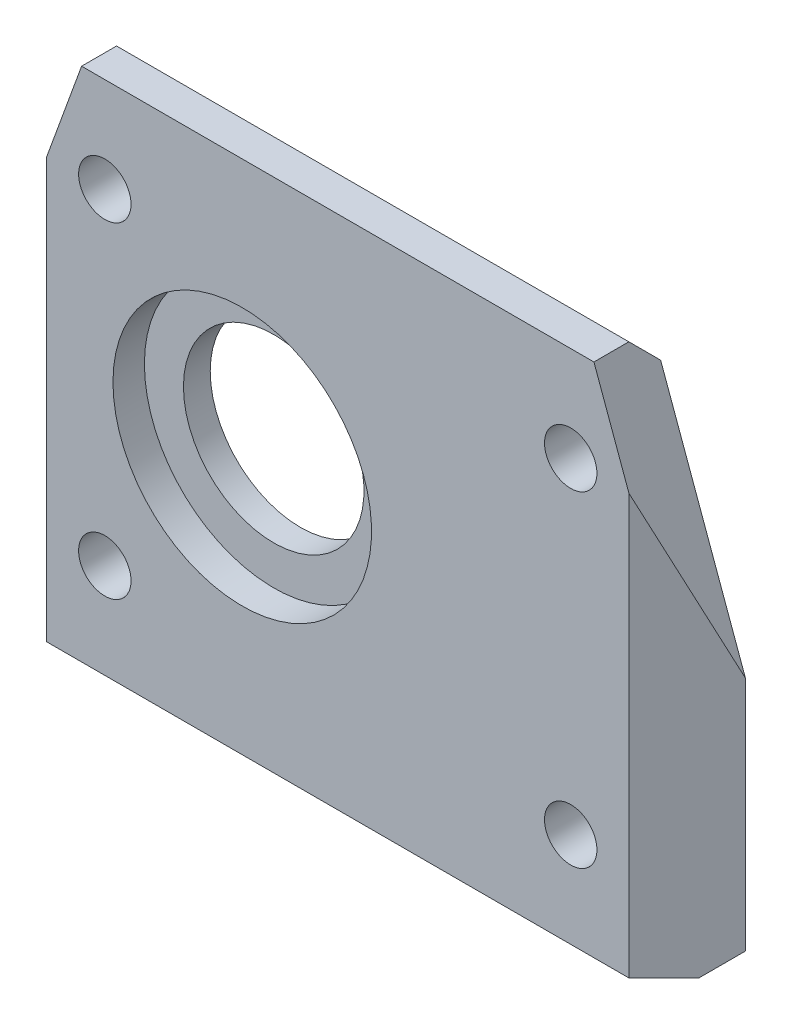
ISO-10303-21;
HEADER;
FILE_DESCRIPTION(('STEP AP214'),'2;1');
FILE_NAME('part.step','',(''),(''),'','','');
FILE_SCHEMA(('AUTOMOTIVE_DESIGN { 1 0 10303 214 1 1 1 1 }'));
ENDSEC;
DATA;
#1=APPLICATION_CONTEXT('core data for automotive mechanical design processes');
#2=APPLICATION_PROTOCOL_DEFINITION('international standard','automotive_design',2000,#1);
#3=PRODUCT_CONTEXT('',#1,'mechanical');
#4=PRODUCT('Part','Part','',(#3));
#5=PRODUCT_RELATED_PRODUCT_CATEGORY('part','',(#4));
#6=PRODUCT_DEFINITION_FORMATION('','',#4);
#7=PRODUCT_DEFINITION_CONTEXT('part definition',#1,'design');
#8=PRODUCT_DEFINITION('design','',#6,#7);
#9=PRODUCT_DEFINITION_SHAPE('','',#8);
#10=(LENGTH_UNIT() NAMED_UNIT(*) SI_UNIT(.MILLI.,.METRE.));
#11=(NAMED_UNIT(*) PLANE_ANGLE_UNIT() SI_UNIT($,.RADIAN.));
#12=(NAMED_UNIT(*) SI_UNIT($,.STERADIAN.) SOLID_ANGLE_UNIT());
#13=UNCERTAINTY_MEASURE_WITH_UNIT(LENGTH_MEASURE(1.E-05),#10,'distance_accuracy_value','');
#14=(GEOMETRIC_REPRESENTATION_CONTEXT(3) GLOBAL_UNCERTAINTY_ASSIGNED_CONTEXT((#13)) GLOBAL_UNIT_ASSIGNED_CONTEXT((#10,
#11,#12)) REPRESENTATION_CONTEXT('',''));
#15=CARTESIAN_POINT('',(0.,0.,0.));
#16=DIRECTION('',(0.,0.,1.));
#17=DIRECTION('',(1.,0.,0.));
#18=AXIS2_PLACEMENT_3D('',#15,#16,#17);
#19=CARTESIAN_POINT('',(-8.2,0.,-5.));
#20=DIRECTION('',(0.,0.,1.));
#21=DIRECTION('',(-1.,0.,0.));
#22=AXIS2_PLACEMENT_3D('',#19,#20,#21);
#23=CYLINDRICAL_SURFACE('',#22,7.75);
#24=CARTESIAN_POINT('',(-8.2,0.,-5.));
#25=DIRECTION('',(0.,0.,1.));
#26=DIRECTION('',(1.,0.,0.));
#27=AXIS2_PLACEMENT_3D('',#24,#25,#26);
#28=CIRCLE('',#27,7.75);
#29=CARTESIAN_POINT('',(-0.450000000000001,0.,-5.));
#30=VERTEX_POINT('',#29);
#31=EDGE_CURVE('E241',#30,#30,#28,.T.);
#32=ORIENTED_EDGE('',*,*,#31,.F.);
#33=EDGE_LOOP('',(#32));
#34=FACE_BOUND('',#33,.T.);
#35=CARTESIAN_POINT('',(-8.2,0.,-2.7));
#36=DIRECTION('',(0.,0.,-1.));
#37=DIRECTION('',(-1.,0.,0.));
#38=AXIS2_PLACEMENT_3D('',#35,#36,#37);
#39=CIRCLE('',#38,7.75);
#40=CARTESIAN_POINT('',(-15.95,0.,-2.7));
#41=VERTEX_POINT('',#40);
#42=EDGE_CURVE('E180',#41,#41,#39,.T.);
#43=ORIENTED_EDGE('',*,*,#42,.F.);
#44=EDGE_LOOP('',(#43));
#45=FACE_BOUND('',#44,.T.);
#46=ADVANCED_FACE('F37',(#34,#45),#23,.F.);
#47=CARTESIAN_POINT('',(-20.,14.,-5.));
#48=DIRECTION('',(0.,0.,1.));
#49=DIRECTION('',(-1.,0.,0.));
#50=AXIS2_PLACEMENT_3D('',#47,#48,#49);
#51=CYLINDRICAL_SURFACE('',#50,2.25);
#52=CARTESIAN_POINT('',(-20.,14.,0.));
#53=DIRECTION('',(0.,0.,1.));
#54=DIRECTION('',(1.,0.,0.));
#55=AXIS2_PLACEMENT_3D('',#52,#53,#54);
#56=CIRCLE('',#55,2.25);
#57=CARTESIAN_POINT('',(-17.75,14.,0.));
#58=VERTEX_POINT('',#57);
#59=EDGE_CURVE('E121',#58,#58,#56,.T.);
#60=ORIENTED_EDGE('',*,*,#59,.T.);
#61=EDGE_LOOP('',(#60));
#62=FACE_BOUND('',#61,.T.);
#63=CARTESIAN_POINT('',(-20.,14.,-4.));
#64=DIRECTION('',(0.,0.,1.));
#65=DIRECTION('',(1.,0.,0.));
#66=AXIS2_PLACEMENT_3D('',#63,#64,#65);
#67=CIRCLE('',#66,2.25);
#68=CARTESIAN_POINT('',(-17.75,14.,-4.));
#69=VERTEX_POINT('',#68);
#70=EDGE_CURVE('E202',#69,#69,#67,.T.);
#71=ORIENTED_EDGE('',*,*,#70,.F.);
#72=EDGE_LOOP('',(#71));
#73=FACE_BOUND('',#72,.T.);
#74=ADVANCED_FACE('F255',(#62,#73),#51,.F.);
#75=CARTESIAN_POINT('',(20.,14.,-5.));
#76=DIRECTION('',(0.,0.,1.));
#77=DIRECTION('',(-1.,0.,0.));
#78=AXIS2_PLACEMENT_3D('',#75,#76,#77);
#79=CYLINDRICAL_SURFACE('',#78,2.25);
#80=CARTESIAN_POINT('',(20.,14.,0.));
#81=DIRECTION('',(0.,0.,1.));
#82=DIRECTION('',(1.,0.,0.));
#83=AXIS2_PLACEMENT_3D('',#80,#81,#82);
#84=CIRCLE('',#83,2.25);
#85=CARTESIAN_POINT('',(22.25,14.,0.));
#86=VERTEX_POINT('',#85);
#87=EDGE_CURVE('E247',#86,#86,#84,.T.);
#88=ORIENTED_EDGE('',*,*,#87,.T.);
#89=EDGE_LOOP('',(#88));
#90=FACE_BOUND('',#89,.T.);
#91=CARTESIAN_POINT('',(20.,14.,-4.));
#92=DIRECTION('',(0.,0.,1.));
#93=DIRECTION('',(1.,0.,0.));
#94=AXIS2_PLACEMENT_3D('',#91,#92,#93);
#95=CIRCLE('',#94,2.25);
#96=CARTESIAN_POINT('',(22.25,14.,-4.));
#97=VERTEX_POINT('',#96);
#98=EDGE_CURVE('E214',#97,#97,#95,.T.);
#99=ORIENTED_EDGE('',*,*,#98,.F.);
#100=EDGE_LOOP('',(#99));
#101=FACE_BOUND('',#100,.T.);
#102=ADVANCED_FACE('F263',(#90,#101),#79,.F.);
#103=CARTESIAN_POINT('',(20.,-14.,-5.));
#104=DIRECTION('',(0.,0.,1.));
#105=DIRECTION('',(-1.,0.,0.));
#106=AXIS2_PLACEMENT_3D('',#103,#104,#105);
#107=CYLINDRICAL_SURFACE('',#106,2.25);
#108=CARTESIAN_POINT('',(20.,-14.,0.));
#109=DIRECTION('',(0.,0.,1.));
#110=DIRECTION('',(1.,0.,0.));
#111=AXIS2_PLACEMENT_3D('',#108,#109,#110);
#112=CIRCLE('',#111,2.25);
#113=CARTESIAN_POINT('',(22.25,-14.,0.));
#114=VERTEX_POINT('',#113);
#115=EDGE_CURVE('E244',#114,#114,#112,.T.);
#116=ORIENTED_EDGE('',*,*,#115,.T.);
#117=EDGE_LOOP('',(#116));
#118=FACE_BOUND('',#117,.T.);
#119=CARTESIAN_POINT('',(20.,-14.,-4.));
#120=DIRECTION('',(0.,0.,1.));
#121=DIRECTION('',(1.,0.,0.));
#122=AXIS2_PLACEMENT_3D('',#119,#120,#121);
#123=CIRCLE('',#122,2.25);
#124=CARTESIAN_POINT('',(22.25,-14.,-4.));
#125=VERTEX_POINT('',#124);
#126=EDGE_CURVE('E226',#125,#125,#123,.T.);
#127=ORIENTED_EDGE('',*,*,#126,.F.);
#128=EDGE_LOOP('',(#127));
#129=FACE_BOUND('',#128,.T.);
#130=ADVANCED_FACE('F266',(#118,#129),#107,.F.);
#131=CARTESIAN_POINT('',(0.,0.,-5.));
#132=DIRECTION('',(0.,0.,1.));
#133=DIRECTION('',(-1.,0.,0.));
#134=AXIS2_PLACEMENT_3D('',#131,#132,#133);
#135=PLANE('',#134);
#136=CARTESIAN_POINT('',(-20.,14.,-5.));
#137=DIRECTION('',(0.,0.,1.));
#138=DIRECTION('',(1.,0.,0.));
#139=AXIS2_PLACEMENT_3D('',#136,#137,#138);
#140=CIRCLE('',#139,4.025);
#141=CARTESIAN_POINT('',(-15.975,14.,-5.));
#142=VERTEX_POINT('',#141);
#143=EDGE_CURVE('E182',#142,#142,#140,.T.);
#144=ORIENTED_EDGE('',*,*,#143,.T.);
#145=EDGE_LOOP('',(#144));
#146=FACE_BOUND('',#145,.T.);
#147=CARTESIAN_POINT('',(20.,14.,-5.));
#148=DIRECTION('',(0.,0.,1.));
#149=DIRECTION('',(1.,0.,0.));
#150=AXIS2_PLACEMENT_3D('',#147,#148,#149);
#151=CIRCLE('',#150,4.025);
#152=CARTESIAN_POINT('',(24.025,14.,-5.));
#153=VERTEX_POINT('',#152);
#154=EDGE_CURVE('E205',#153,#153,#151,.T.);
#155=ORIENTED_EDGE('',*,*,#154,.T.);
#156=EDGE_LOOP('',(#155));
#157=FACE_BOUND('',#156,.T.);
#158=ORIENTED_EDGE('',*,*,#31,.T.);
#159=EDGE_LOOP('',(#158));
#160=FACE_BOUND('',#159,.T.);
#161=DIRECTION('',(0.,-1.,0.));
#162=VECTOR('',#161,1.);
#163=CARTESIAN_POINT('',(-30.,-22.15,-5.));
#164=LINE('',#163,#162);
#165=CARTESIAN_POINT('',(-30.,0.149999999999786,-5.));
#166=VERTEX_POINT('',#165);
#167=CARTESIAN_POINT('',(-30.,-20.15,-5.));
#168=VERTEX_POINT('',#167);
#169=EDGE_CURVE('E163',#166,#168,#164,.T.);
#170=ORIENTED_EDGE('',*,*,#169,.F.);
#171=DIRECTION('',(0.342020143325667,0.939692620785909,0.));
#172=VECTOR('',#171,1.);
#173=CARTESIAN_POINT('',(-30.,0.149999999999786,-5.));
#174=LINE('',#173,#172);
#175=CARTESIAN_POINT('',(-22.7205953146759,20.15,-5.));
#176=VERTEX_POINT('',#175);
#177=EDGE_CURVE('E127',#176,#166,#174,.F.);
#178=ORIENTED_EDGE('',*,*,#177,.F.);
#179=DIRECTION('',(-1.,0.,0.));
#180=VECTOR('',#179,1.);
#181=CARTESIAN_POINT('',(0.,20.15,-5.));
#182=LINE('',#181,#180);
#183=CARTESIAN_POINT('',(22.7205953146759,20.15,-5.));
#184=VERTEX_POINT('',#183);
#185=EDGE_CURVE('E134',#184,#176,#182,.T.);
#186=ORIENTED_EDGE('',*,*,#185,.F.);
#187=DIRECTION('',(0.342020143325666,-0.939692620785909,0.));
#188=VECTOR('',#187,1.);
#189=CARTESIAN_POINT('',(21.9926548461435,22.15,-5.));
#190=LINE('',#189,#188);
#191=CARTESIAN_POINT('',(30.,0.149999999999786,-5.));
#192=VERTEX_POINT('',#191);
#193=EDGE_CURVE('E129',#192,#184,#190,.F.);
#194=ORIENTED_EDGE('',*,*,#193,.F.);
#195=DIRECTION('',(0.,1.,0.));
#196=VECTOR('',#195,1.);
#197=CARTESIAN_POINT('',(30.,-22.15,-5.));
#198=LINE('',#197,#196);
#199=CARTESIAN_POINT('',(30.,-20.15,-5.));
#200=VERTEX_POINT('',#199);
#201=EDGE_CURVE('E173',#200,#192,#198,.T.);
#202=ORIENTED_EDGE('',*,*,#201,.F.);
#203=DIRECTION('',(1.,0.,0.));
#204=VECTOR('',#203,1.);
#205=CARTESIAN_POINT('',(0.,-20.15,-5.));
#206=LINE('',#205,#204);
#207=EDGE_CURVE('E137',#168,#200,#206,.T.);
#208=ORIENTED_EDGE('',*,*,#207,.F.);
#209=EDGE_LOOP('',(#170,#178,#186,#194,#202,#208));
#210=FACE_BOUND('',#209,.T.);
#211=CARTESIAN_POINT('',(-20.,-14.,-5.));
#212=DIRECTION('',(0.,0.,1.));
#213=DIRECTION('',(1.,0.,0.));
#214=AXIS2_PLACEMENT_3D('',#211,#212,#213);
#215=CIRCLE('',#214,4.025);
#216=CARTESIAN_POINT('',(-15.975,-14.,-5.));
#217=VERTEX_POINT('',#216);
#218=EDGE_CURVE('E229',#217,#217,#215,.T.);
#219=ORIENTED_EDGE('',*,*,#218,.T.);
#220=EDGE_LOOP('',(#219));
#221=FACE_BOUND('',#220,.T.);
#222=CARTESIAN_POINT('',(20.,-14.,-5.));
#223=DIRECTION('',(0.,0.,1.));
#224=DIRECTION('',(1.,0.,0.));
#225=AXIS2_PLACEMENT_3D('',#222,#223,#224);
#226=CIRCLE('',#225,4.025);
#227=CARTESIAN_POINT('',(24.025,-14.,-5.));
#228=VERTEX_POINT('',#227);
#229=EDGE_CURVE('E217',#228,#228,#226,.T.);
#230=ORIENTED_EDGE('',*,*,#229,.T.);
#231=EDGE_LOOP('',(#230));
#232=FACE_BOUND('',#231,.T.);
#233=ADVANCED_FACE('F170',(#146,#157,#160,#210,#221,#232),#135,.F.);
#234=CARTESIAN_POINT('',(0.,0.,0.));
#235=DIRECTION('',(0.,0.,1.));
#236=DIRECTION('',(-1.,0.,0.));
#237=AXIS2_PLACEMENT_3D('',#234,#235,#236);
#238=PLANE('',#237);
#239=CARTESIAN_POINT('',(-8.2,0.,0.));
#240=DIRECTION('',(0.,0.,-1.));
#241=DIRECTION('',(-1.,0.,0.));
#242=AXIS2_PLACEMENT_3D('',#239,#240,#241);
#243=CIRCLE('',#242,11.1);
#244=CARTESIAN_POINT('',(-19.3,0.,0.));
#245=VERTEX_POINT('',#244);
#246=EDGE_CURVE('E190',#245,#245,#243,.T.);
#247=ORIENTED_EDGE('',*,*,#246,.T.);
#248=EDGE_LOOP('',(#247));
#249=FACE_BOUND('',#248,.T.);
#250=ORIENTED_EDGE('',*,*,#115,.F.);
#251=EDGE_LOOP('',(#250));
#252=FACE_BOUND('',#251,.T.);
#253=CARTESIAN_POINT('',(-20.,-14.,0.));
#254=DIRECTION('',(0.,0.,1.));
#255=DIRECTION('',(1.,0.,0.));
#256=AXIS2_PLACEMENT_3D('',#253,#254,#255);
#257=CIRCLE('',#256,2.25);
#258=CARTESIAN_POINT('',(-17.75,-14.,0.));
#259=VERTEX_POINT('',#258);
#260=EDGE_CURVE('E250',#259,#259,#257,.T.);
#261=ORIENTED_EDGE('',*,*,#260,.F.);
#262=EDGE_LOOP('',(#261));
#263=FACE_BOUND('',#262,.T.);
#264=DIRECTION('',(1.,0.,0.));
#265=VECTOR('',#264,1.);
#266=CARTESIAN_POINT('',(-30.,-22.15,0.));
#267=LINE('',#266,#265);
#268=CARTESIAN_POINT('',(-25.,-22.15,0.));
#269=VERTEX_POINT('',#268);
#270=CARTESIAN_POINT('',(25.,-22.15,0.));
#271=VERTEX_POINT('',#270);
#272=EDGE_CURVE('E120',#269,#271,#267,.T.);
#273=ORIENTED_EDGE('',*,*,#272,.T.);
#274=DIRECTION('',(0.,-1.,0.));
#275=VECTOR('',#274,1.);
#276=CARTESIAN_POINT('',(25.,-22.15,0.));
#277=LINE('',#276,#275);
#278=CARTESIAN_POINT('',(25.,13.887387097273,0.));
#279=VERTEX_POINT('',#278);
#280=EDGE_CURVE('E126',#279,#271,#277,.T.);
#281=ORIENTED_EDGE('',*,*,#280,.F.);
#282=DIRECTION('',(-0.342020143325666,0.939692620785909,0.));
#283=VECTOR('',#282,1.);
#284=CARTESIAN_POINT('',(26.5388757175111,9.65936081206408,0.));
#285=LINE('',#284,#283);
#286=CARTESIAN_POINT('',(21.9926548461435,22.15,0.));
#287=VERTEX_POINT('',#286);
#288=EDGE_CURVE('E105',#287,#279,#285,.F.);
#289=ORIENTED_EDGE('',*,*,#288,.F.);
#290=DIRECTION('',(-1.,0.,0.));
#291=VECTOR('',#290,1.);
#292=CARTESIAN_POINT('',(-30.,22.15,0.));
#293=LINE('',#292,#291);
#294=CARTESIAN_POINT('',(-21.9926548461435,22.15,0.));
#295=VERTEX_POINT('',#294);
#296=EDGE_CURVE('E115',#287,#295,#293,.T.);
#297=ORIENTED_EDGE('',*,*,#296,.T.);
#298=DIRECTION('',(-0.342020143325667,-0.939692620785909,0.));
#299=VECTOR('',#298,1.);
#300=CARTESIAN_POINT('',(-26.5388757175111,9.65936081206409,0.));
#301=LINE('',#300,#299);
#302=CARTESIAN_POINT('',(-25.,13.887387097273,0.));
#303=VERTEX_POINT('',#302);
#304=EDGE_CURVE('E111',#303,#295,#301,.F.);
#305=ORIENTED_EDGE('',*,*,#304,.F.);
#306=DIRECTION('',(0.,1.,0.));
#307=VECTOR('',#306,1.);
#308=CARTESIAN_POINT('',(-25.,0.149999999999786,0.));
#309=LINE('',#308,#307);
#310=EDGE_CURVE('E158',#269,#303,#309,.T.);
#311=ORIENTED_EDGE('',*,*,#310,.F.);
#312=EDGE_LOOP('',(#273,#281,#289,#297,#305,#311));
#313=FACE_BOUND('',#312,.T.);
#314=ORIENTED_EDGE('',*,*,#59,.F.);
#315=EDGE_LOOP('',(#314));
#316=FACE_BOUND('',#315,.T.);
#317=ORIENTED_EDGE('',*,*,#87,.F.);
#318=EDGE_LOOP('',(#317));
#319=FACE_BOUND('',#318,.T.);
#320=ADVANCED_FACE('F124',(#249,#252,#263,#313,#316,#319),#238,.T.);
#321=CARTESIAN_POINT('',(-30.,22.15,-5.));
#322=DIRECTION('',(0.,-1.,0.));
#323=DIRECTION('',(0.,0.,1.));
#324=AXIS2_PLACEMENT_3D('',#321,#322,#323);
#325=PLANE('',#324);
#326=DIRECTION('',(0.,0.,-1.));
#327=VECTOR('',#326,1.);
#328=CARTESIAN_POINT('',(-21.9926548461435,22.15,-5.));
#329=LINE('',#328,#327);
#330=CARTESIAN_POINT('',(-21.9926548461435,22.15,-2.99999999999999));
#331=VERTEX_POINT('',#330);
#332=EDGE_CURVE('E112',#295,#331,#329,.T.);
#333=ORIENTED_EDGE('',*,*,#332,.F.);
#334=ORIENTED_EDGE('',*,*,#296,.F.);
#335=DIRECTION('',(0.,0.,1.));
#336=VECTOR('',#335,1.);
#337=CARTESIAN_POINT('',(21.9926548461435,22.15,-5.));
#338=LINE('',#337,#336);
#339=CARTESIAN_POINT('',(21.9926548461435,22.15,-2.99999999999999));
#340=VERTEX_POINT('',#339);
#341=EDGE_CURVE('E100',#340,#287,#338,.T.);
#342=ORIENTED_EDGE('',*,*,#341,.F.);
#343=DIRECTION('',(1.,0.,0.));
#344=VECTOR('',#343,1.);
#345=CARTESIAN_POINT('',(-30.,22.15,-2.99999999999999));
#346=LINE('',#345,#344);
#347=EDGE_CURVE('E145',#331,#340,#346,.T.);
#348=ORIENTED_EDGE('',*,*,#347,.F.);
#349=EDGE_LOOP('',(#333,#334,#342,#348));
#350=FACE_BOUND('',#349,.T.);
#351=ADVANCED_FACE('F116',(#350),#325,.F.);
#352=CARTESIAN_POINT('',(-30.,-22.15,-5.));
#353=DIRECTION('',(0.,1.,0.));
#354=DIRECTION('',(0.,0.,-1.));
#355=AXIS2_PLACEMENT_3D('',#352,#353,#354);
#356=PLANE('',#355);
#357=DIRECTION('',(-1.,0.,0.));
#358=VECTOR('',#357,1.);
#359=CARTESIAN_POINT('',(-30.,-22.15,-2.99999999999999));
#360=LINE('',#359,#358);
#361=CARTESIAN_POINT('',(28.,-22.15,-2.99999999999999));
#362=VERTEX_POINT('',#361);
#363=CARTESIAN_POINT('',(-28.,-22.15,-2.99999999999999));
#364=VERTEX_POINT('',#363);
#365=EDGE_CURVE('E140',#362,#364,#360,.T.);
#366=ORIENTED_EDGE('',*,*,#365,.F.);
#367=DIRECTION('',(0.707106781186548,0.,-0.707106781186547));
#368=VECTOR('',#367,1.);
#369=CARTESIAN_POINT('',(30.,-22.15,-5.));
#370=LINE('',#369,#368);
#371=EDGE_CURVE('E152',#271,#362,#370,.T.);
#372=ORIENTED_EDGE('',*,*,#371,.F.);
#373=ORIENTED_EDGE('',*,*,#272,.F.);
#374=DIRECTION('',(0.707106781186548,0.,0.707106781186547));
#375=VECTOR('',#374,1.);
#376=CARTESIAN_POINT('',(-30.,-22.15,-5.));
#377=LINE('',#376,#375);
#378=EDGE_CURVE('E155',#364,#269,#377,.T.);
#379=ORIENTED_EDGE('',*,*,#378,.F.);
#380=EDGE_LOOP('',(#366,#372,#373,#379));
#381=FACE_BOUND('',#380,.T.);
#382=ADVANCED_FACE('F312',(#381),#356,.F.);
#383=CARTESIAN_POINT('',(-20.,-14.,-5.));
#384=DIRECTION('',(0.,0.,1.));
#385=DIRECTION('',(-1.,0.,0.));
#386=AXIS2_PLACEMENT_3D('',#383,#384,#385);
#387=CYLINDRICAL_SURFACE('',#386,2.25);
#388=CARTESIAN_POINT('',(-20.,-14.,-4.));
#389=DIRECTION('',(0.,0.,1.));
#390=DIRECTION('',(1.,0.,0.));
#391=AXIS2_PLACEMENT_3D('',#388,#389,#390);
#392=CIRCLE('',#391,2.25);
#393=CARTESIAN_POINT('',(-17.75,-14.,-4.));
#394=VERTEX_POINT('',#393);
#395=EDGE_CURVE('E238',#394,#394,#392,.T.);
#396=ORIENTED_EDGE('',*,*,#395,.F.);
#397=EDGE_LOOP('',(#396));
#398=FACE_BOUND('',#397,.T.);
#399=ORIENTED_EDGE('',*,*,#260,.T.);
#400=EDGE_LOOP('',(#399));
#401=FACE_BOUND('',#400,.T.);
#402=ADVANCED_FACE('F310',(#398,#401),#387,.F.);
#403=CARTESIAN_POINT('',(-16.,-14.,-4.));
#404=DIRECTION('',(0.,0.,1.));
#405=DIRECTION('',(-1.,0.,0.));
#406=AXIS2_PLACEMENT_3D('',#403,#404,#405);
#407=PLANE('',#406);
#408=ORIENTED_EDGE('',*,*,#395,.T.);
#409=EDGE_LOOP('',(#408));
#410=FACE_BOUND('',#409,.T.);
#411=CARTESIAN_POINT('',(-20.,-14.,-4.));
#412=DIRECTION('',(0.,0.,1.));
#413=DIRECTION('',(1.,0.,0.));
#414=AXIS2_PLACEMENT_3D('',#411,#412,#413);
#415=CIRCLE('',#414,4.);
#416=CARTESIAN_POINT('',(-16.,-14.,-4.));
#417=VERTEX_POINT('',#416);
#418=EDGE_CURVE('E235',#417,#417,#415,.T.);
#419=ORIENTED_EDGE('',*,*,#418,.F.);
#420=EDGE_LOOP('',(#419));
#421=FACE_BOUND('',#420,.T.);
#422=ADVANCED_FACE('F305',(#410,#421),#407,.F.);
#423=CARTESIAN_POINT('',(-20.,-14.,-5.));
#424=DIRECTION('',(0.,0.,-1.));
#425=DIRECTION('',(1.,0.,0.));
#426=AXIS2_PLACEMENT_3D('',#423,#424,#425);
#427=CYLINDRICAL_SURFACE('',#426,4.);
#428=ORIENTED_EDGE('',*,*,#418,.T.);
#429=EDGE_LOOP('',(#428));
#430=FACE_BOUND('',#429,.T.);
#431=CARTESIAN_POINT('',(-20.,-14.,-4.975));
#432=DIRECTION('',(0.,0.,1.));
#433=DIRECTION('',(1.,0.,0.));
#434=AXIS2_PLACEMENT_3D('',#431,#432,#433);
#435=CIRCLE('',#434,4.);
#436=CARTESIAN_POINT('',(-16.,-14.,-4.975));
#437=VERTEX_POINT('',#436);
#438=EDGE_CURVE('E232',#437,#437,#435,.T.);
#439=ORIENTED_EDGE('',*,*,#438,.F.);
#440=EDGE_LOOP('',(#439));
#441=FACE_BOUND('',#440,.T.);
#442=ADVANCED_FACE('F473',(#430,#441),#427,.F.);
#443=CARTESIAN_POINT('',(-20.,-14.,-5.));
#444=DIRECTION('',(0.,0.,-1.));
#445=DIRECTION('',(1.,0.,0.));
#446=AXIS2_PLACEMENT_3D('',#443,#444,#445);
#447=CONICAL_SURFACE('',#446,4.025,0.785398163397431);
#448=ORIENTED_EDGE('',*,*,#438,.T.);
#449=EDGE_LOOP('',(#448));
#450=FACE_BOUND('',#449,.T.);
#451=ORIENTED_EDGE('',*,*,#218,.F.);
#452=EDGE_LOOP('',(#451));
#453=FACE_BOUND('',#452,.T.);
#454=ADVANCED_FACE('F463',(#450,#453),#447,.F.);
#455=CARTESIAN_POINT('',(24.,-14.,-4.));
#456=DIRECTION('',(0.,0.,1.));
#457=DIRECTION('',(-1.,0.,0.));
#458=AXIS2_PLACEMENT_3D('',#455,#456,#457);
#459=PLANE('',#458);
#460=ORIENTED_EDGE('',*,*,#126,.T.);
#461=EDGE_LOOP('',(#460));
#462=FACE_BOUND('',#461,.T.);
#463=CARTESIAN_POINT('',(20.,-14.,-4.));
#464=DIRECTION('',(0.,0.,1.));
#465=DIRECTION('',(1.,0.,0.));
#466=AXIS2_PLACEMENT_3D('',#463,#464,#465);
#467=CIRCLE('',#466,4.);
#468=CARTESIAN_POINT('',(24.,-14.,-4.));
#469=VERTEX_POINT('',#468);
#470=EDGE_CURVE('E223',#469,#469,#467,.T.);
#471=ORIENTED_EDGE('',*,*,#470,.F.);
#472=EDGE_LOOP('',(#471));
#473=FACE_BOUND('',#472,.T.);
#474=ADVANCED_FACE('F453',(#462,#473),#459,.F.);
#475=CARTESIAN_POINT('',(20.,-14.,-5.));
#476=DIRECTION('',(0.,0.,-1.));
#477=DIRECTION('',(1.,0.,0.));
#478=AXIS2_PLACEMENT_3D('',#475,#476,#477);
#479=CYLINDRICAL_SURFACE('',#478,4.);
#480=ORIENTED_EDGE('',*,*,#470,.T.);
#481=EDGE_LOOP('',(#480));
#482=FACE_BOUND('',#481,.T.);
#483=CARTESIAN_POINT('',(20.,-14.,-4.975));
#484=DIRECTION('',(0.,0.,1.));
#485=DIRECTION('',(1.,0.,0.));
#486=AXIS2_PLACEMENT_3D('',#483,#484,#485);
#487=CIRCLE('',#486,4.);
#488=CARTESIAN_POINT('',(24.,-14.,-4.975));
#489=VERTEX_POINT('',#488);
#490=EDGE_CURVE('E220',#489,#489,#487,.T.);
#491=ORIENTED_EDGE('',*,*,#490,.F.);
#492=EDGE_LOOP('',(#491));
#493=FACE_BOUND('',#492,.T.);
#494=ADVANCED_FACE('F443',(#482,#493),#479,.F.);
#495=CARTESIAN_POINT('',(20.,-14.,-5.));
#496=DIRECTION('',(0.,0.,-1.));
#497=DIRECTION('',(1.,0.,0.));
#498=AXIS2_PLACEMENT_3D('',#495,#496,#497);
#499=CONICAL_SURFACE('',#498,4.025,0.785398163397431);
#500=ORIENTED_EDGE('',*,*,#490,.T.);
#501=EDGE_LOOP('',(#500));
#502=FACE_BOUND('',#501,.T.);
#503=ORIENTED_EDGE('',*,*,#229,.F.);
#504=EDGE_LOOP('',(#503));
#505=FACE_BOUND('',#504,.T.);
#506=ADVANCED_FACE('F274',(#502,#505),#499,.F.);
#507=CARTESIAN_POINT('',(24.,14.,-4.));
#508=DIRECTION('',(0.,0.,1.));
#509=DIRECTION('',(-1.,0.,0.));
#510=AXIS2_PLACEMENT_3D('',#507,#508,#509);
#511=PLANE('',#510);
#512=ORIENTED_EDGE('',*,*,#98,.T.);
#513=EDGE_LOOP('',(#512));
#514=FACE_BOUND('',#513,.T.);
#515=CARTESIAN_POINT('',(20.,14.,-4.));
#516=DIRECTION('',(0.,0.,1.));
#517=DIRECTION('',(1.,0.,0.));
#518=AXIS2_PLACEMENT_3D('',#515,#516,#517);
#519=CIRCLE('',#518,4.);
#520=CARTESIAN_POINT('',(24.,14.,-4.));
#521=VERTEX_POINT('',#520);
#522=EDGE_CURVE('E211',#521,#521,#519,.T.);
#523=ORIENTED_EDGE('',*,*,#522,.F.);
#524=EDGE_LOOP('',(#523));
#525=FACE_BOUND('',#524,.T.);
#526=ADVANCED_FACE('F270',(#514,#525),#511,.F.);
#527=CARTESIAN_POINT('',(20.,14.,-5.));
#528=DIRECTION('',(0.,0.,-1.));
#529=DIRECTION('',(1.,0.,0.));
#530=AXIS2_PLACEMENT_3D('',#527,#528,#529);
#531=CYLINDRICAL_SURFACE('',#530,4.);
#532=ORIENTED_EDGE('',*,*,#522,.T.);
#533=EDGE_LOOP('',(#532));
#534=FACE_BOUND('',#533,.T.);
#535=CARTESIAN_POINT('',(20.,14.,-4.975));
#536=DIRECTION('',(0.,0.,1.));
#537=DIRECTION('',(1.,0.,0.));
#538=AXIS2_PLACEMENT_3D('',#535,#536,#537);
#539=CIRCLE('',#538,4.);
#540=CARTESIAN_POINT('',(24.,14.,-4.975));
#541=VERTEX_POINT('',#540);
#542=EDGE_CURVE('E208',#541,#541,#539,.T.);
#543=ORIENTED_EDGE('',*,*,#542,.F.);
#544=EDGE_LOOP('',(#543));
#545=FACE_BOUND('',#544,.T.);
#546=ADVANCED_FACE('F273',(#534,#545),#531,.F.);
#547=CARTESIAN_POINT('',(20.,14.,-5.));
#548=DIRECTION('',(0.,0.,-1.));
#549=DIRECTION('',(1.,0.,0.));
#550=AXIS2_PLACEMENT_3D('',#547,#548,#549);
#551=CONICAL_SURFACE('',#550,4.025,0.785398163397431);
#552=ORIENTED_EDGE('',*,*,#542,.T.);
#553=EDGE_LOOP('',(#552));
#554=FACE_BOUND('',#553,.T.);
#555=ORIENTED_EDGE('',*,*,#154,.F.);
#556=EDGE_LOOP('',(#555));
#557=FACE_BOUND('',#556,.T.);
#558=ADVANCED_FACE('F280',(#554,#557),#551,.F.);
#559=CARTESIAN_POINT('',(-16.,14.,-4.));
#560=DIRECTION('',(0.,0.,1.));
#561=DIRECTION('',(-1.,0.,0.));
#562=AXIS2_PLACEMENT_3D('',#559,#560,#561);
#563=PLANE('',#562);
#564=ORIENTED_EDGE('',*,*,#70,.T.);
#565=EDGE_LOOP('',(#564));
#566=FACE_BOUND('',#565,.T.);
#567=CARTESIAN_POINT('',(-20.,14.,-4.));
#568=DIRECTION('',(0.,0.,1.));
#569=DIRECTION('',(1.,0.,0.));
#570=AXIS2_PLACEMENT_3D('',#567,#568,#569);
#571=CIRCLE('',#570,4.);
#572=CARTESIAN_POINT('',(-16.,14.,-4.));
#573=VERTEX_POINT('',#572);
#574=EDGE_CURVE('E199',#573,#573,#571,.T.);
#575=ORIENTED_EDGE('',*,*,#574,.F.);
#576=EDGE_LOOP('',(#575));
#577=FACE_BOUND('',#576,.T.);
#578=ADVANCED_FACE('F286',(#566,#577),#563,.F.);
#579=CARTESIAN_POINT('',(-20.,14.,-5.));
#580=DIRECTION('',(0.,0.,-1.));
#581=DIRECTION('',(1.,0.,0.));
#582=AXIS2_PLACEMENT_3D('',#579,#580,#581);
#583=CYLINDRICAL_SURFACE('',#582,4.);
#584=ORIENTED_EDGE('',*,*,#574,.T.);
#585=EDGE_LOOP('',(#584));
#586=FACE_BOUND('',#585,.T.);
#587=CARTESIAN_POINT('',(-20.,14.,-4.975));
#588=DIRECTION('',(0.,0.,1.));
#589=DIRECTION('',(1.,0.,0.));
#590=AXIS2_PLACEMENT_3D('',#587,#588,#589);
#591=CIRCLE('',#590,4.);
#592=CARTESIAN_POINT('',(-16.,14.,-4.975));
#593=VERTEX_POINT('',#592);
#594=EDGE_CURVE('E187',#593,#593,#591,.T.);
#595=ORIENTED_EDGE('',*,*,#594,.F.);
#596=EDGE_LOOP('',(#595));
#597=FACE_BOUND('',#596,.T.);
#598=ADVANCED_FACE('F397',(#586,#597),#583,.F.);
#599=CARTESIAN_POINT('',(-20.,14.,-5.));
#600=DIRECTION('',(0.,0.,-1.));
#601=DIRECTION('',(1.,0.,0.));
#602=AXIS2_PLACEMENT_3D('',#599,#600,#601);
#603=CONICAL_SURFACE('',#602,4.025,0.785398163397431);
#604=ORIENTED_EDGE('',*,*,#594,.T.);
#605=EDGE_LOOP('',(#604));
#606=FACE_BOUND('',#605,.T.);
#607=ORIENTED_EDGE('',*,*,#143,.F.);
#608=EDGE_LOOP('',(#607));
#609=FACE_BOUND('',#608,.T.);
#610=ADVANCED_FACE('F388',(#606,#609),#603,.F.);
#611=CARTESIAN_POINT('',(-8.2,0.,-2.7));
#612=DIRECTION('',(0.,0.,1.));
#613=DIRECTION('',(-1.,0.,0.));
#614=AXIS2_PLACEMENT_3D('',#611,#612,#613);
#615=CYLINDRICAL_SURFACE('',#614,11.1);
#616=CARTESIAN_POINT('',(-8.2,0.,-2.7));
#617=DIRECTION('',(0.,0.,-1.));
#618=DIRECTION('',(-1.,0.,0.));
#619=AXIS2_PLACEMENT_3D('',#616,#617,#618);
#620=CIRCLE('',#619,11.1);
#621=CARTESIAN_POINT('',(-19.3,0.,-2.7));
#622=VERTEX_POINT('',#621);
#623=EDGE_CURVE('E183',#622,#622,#620,.T.);
#624=CARTESIAN_POINT('',(-19.3,0.,-2.7));
#625=CARTESIAN_POINT('',(-19.3,0.,-2.671875));
#626=CARTESIAN_POINT('',(-19.3,0.,-2.64375));
#627=CARTESIAN_POINT('',(-19.3,0.,-2.5875));
#628=CARTESIAN_POINT('',(-19.3,0.,-2.559375));
#629=CARTESIAN_POINT('',(-19.3,0.,-2.503125));
#630=CARTESIAN_POINT('',(-19.3,0.,-2.475));
#631=CARTESIAN_POINT('',(-19.3,0.,-2.41875));
#632=CARTESIAN_POINT('',(-19.3,0.,-2.390625));
#633=CARTESIAN_POINT('',(-19.3,0.,-2.334375));
#634=CARTESIAN_POINT('',(-19.3,0.,-2.30625));
#635=CARTESIAN_POINT('',(-19.3,0.,-2.25));
#636=CARTESIAN_POINT('',(-19.3,0.,-2.221875));
#637=CARTESIAN_POINT('',(-19.3,0.,-2.165625));
#638=CARTESIAN_POINT('',(-19.3,0.,-2.1375));
#639=CARTESIAN_POINT('',(-19.3,0.,-2.08125));
#640=CARTESIAN_POINT('',(-19.3,0.,-2.053125));
#641=CARTESIAN_POINT('',(-19.3,0.,-1.996875));
#642=CARTESIAN_POINT('',(-19.3,0.,-1.96875));
#643=CARTESIAN_POINT('',(-19.3,0.,-1.9125));
#644=CARTESIAN_POINT('',(-19.3,0.,-1.884375));
#645=CARTESIAN_POINT('',(-19.3,0.,-1.828125));
#646=CARTESIAN_POINT('',(-19.3,0.,-1.8));
#647=CARTESIAN_POINT('',(-19.3,0.,-1.74375));
#648=CARTESIAN_POINT('',(-19.3,0.,-1.715625));
#649=CARTESIAN_POINT('',(-19.3,0.,-1.659375));
#650=CARTESIAN_POINT('',(-19.3,0.,-1.63125));
#651=CARTESIAN_POINT('',(-19.3,0.,-1.575));
#652=CARTESIAN_POINT('',(-19.3,0.,-1.546875));
#653=CARTESIAN_POINT('',(-19.3,0.,-1.490625));
#654=CARTESIAN_POINT('',(-19.3,0.,-1.4625));
#655=CARTESIAN_POINT('',(-19.3,0.,-1.40625));
#656=CARTESIAN_POINT('',(-19.3,0.,-1.378125));
#657=CARTESIAN_POINT('',(-19.3,0.,-1.321875));
#658=CARTESIAN_POINT('',(-19.3,0.,-1.29375));
#659=CARTESIAN_POINT('',(-19.3,0.,-1.2375));
#660=CARTESIAN_POINT('',(-19.3,0.,-1.209375));
#661=CARTESIAN_POINT('',(-19.3,0.,-1.153125));
#662=CARTESIAN_POINT('',(-19.3,0.,-1.125));
#663=CARTESIAN_POINT('',(-19.3,0.,-1.06875));
#664=CARTESIAN_POINT('',(-19.3,0.,-1.040625));
#665=CARTESIAN_POINT('',(-19.3,0.,-0.984375));
#666=CARTESIAN_POINT('',(-19.3,0.,-0.95625));
#667=CARTESIAN_POINT('',(-19.3,0.,-0.9));
#668=CARTESIAN_POINT('',(-19.3,0.,-0.871875));
#669=CARTESIAN_POINT('',(-19.3,0.,-0.815625));
#670=CARTESIAN_POINT('',(-19.3,0.,-0.7875));
#671=CARTESIAN_POINT('',(-19.3,0.,-0.73125));
#672=CARTESIAN_POINT('',(-19.3,0.,-0.703125));
#673=CARTESIAN_POINT('',(-19.3,0.,-0.646875));
#674=CARTESIAN_POINT('',(-19.3,0.,-0.61875));
#675=CARTESIAN_POINT('',(-19.3,0.,-0.5625));
#676=CARTESIAN_POINT('',(-19.3,0.,-0.534375));
#677=CARTESIAN_POINT('',(-19.3,0.,-0.478125));
#678=CARTESIAN_POINT('',(-19.3,0.,-0.45));
#679=CARTESIAN_POINT('',(-19.3,0.,-0.39375));
#680=CARTESIAN_POINT('',(-19.3,0.,-0.365625));
#681=CARTESIAN_POINT('',(-19.3,0.,-0.309375));
#682=CARTESIAN_POINT('',(-19.3,0.,-0.28125));
#683=CARTESIAN_POINT('',(-19.3,0.,-0.225));
#684=CARTESIAN_POINT('',(-19.3,0.,-0.196875));
#685=CARTESIAN_POINT('',(-19.3,0.,-0.140625));
#686=CARTESIAN_POINT('',(-19.3,0.,-0.112499999999999));
#687=CARTESIAN_POINT('',(-19.3,0.,-0.0562499999999994));
#688=CARTESIAN_POINT('',(-19.3,0.,-0.0281249999999995));
#689=CARTESIAN_POINT('',(-19.3,0.,0.));
#690=B_SPLINE_CURVE_WITH_KNOTS('',3,(#624,#625,#626,#627,#628,#629,#630,#631,#632,#633,#634,
#635,#636,#637,#638,#639,#640,#641,#642,#643,#644,#645,#646,#647,#648,#649,#650,#651,#652,#653,
#654,#655,#656,#657,#658,#659,#660,#661,#662,#663,#664,#665,#666,#667,#668,#669,#670,#671,#672,
#673,#674,#675,#676,#677,#678,#679,#680,#681,#682,#683,#684,#685,#686,#687,#688,#689),
.UNSPECIFIED.,.F.,.F.,(4,2,2,2,2,2,2,2,2,2,2,2,2,2,2,2,2,2,2,2,2,2,2,2,2,2,2,2,2,2,2,2,4),(0.,
0.0843749999999998,0.16875,0.253125,0.3375,0.421875,0.50625,0.590625,0.675,0.759375,0.84375,
0.928125,1.0125,1.096875,1.18125,1.265625,1.35,1.434375,1.51875,1.603125,1.6875,1.771875,
1.85625,1.940625,2.025,2.109375,2.19375,2.278125,2.3625,2.446875,2.53125,2.615625,2.7),.UNSPECIFIED.);
#691=EDGE_CURVE('BSEAM379',#622,#245,#690,.T.);
#692=ORIENTED_EDGE('',*,*,#623,.T.);
#693=ORIENTED_EDGE('',*,*,#246,.F.);
#694=ORIENTED_EDGE('',*,*,#691,.T.);
#695=ORIENTED_EDGE('',*,*,#691,.F.);
#696=EDGE_LOOP('',(#692,#694,#693,#695));
#697=FACE_BOUND('',#696,.T.);
#698=ADVANCED_FACE('F379',(#697),#615,.F.);
#699=CARTESIAN_POINT('',(-8.2,0.,-2.7));
#700=DIRECTION('',(0.,0.,1.));
#701=DIRECTION('',(-1.,0.,0.));
#702=AXIS2_PLACEMENT_3D('',#699,#700,#701);
#703=PLANE('',#702);
#704=ORIENTED_EDGE('',*,*,#42,.T.);
#705=EDGE_LOOP('',(#704));
#706=FACE_BOUND('',#705,.T.);
#707=ORIENTED_EDGE('',*,*,#623,.F.);
#708=EDGE_LOOP('',(#707));
#709=FACE_BOUND('',#708,.T.);
#710=ADVANCED_FACE('F322',(#706,#709),#703,.T.);
#711=CARTESIAN_POINT('',(21.9926548461435,22.15,-5.));
#712=DIRECTION('',(-0.939692620785909,-0.342020143325666,0.));
#713=DIRECTION('',(0.,0.,1.));
#714=AXIS2_PLACEMENT_3D('',#711,#712,#713);
#715=PLANE('',#714);
#716=ORIENTED_EDGE('',*,*,#193,.T.);
#717=DIRECTION('',(0.249243569363952,-0.684791078771734,-0.684791078771739));
#718=VECTOR('',#717,1.);
#719=CARTESIAN_POINT('',(22.3340143916269,21.2121223568693,-3.93787764313072));
#720=LINE('',#719,#718);
#721=EDGE_CURVE('E107',#340,#184,#720,.T.);
#722=ORIENTED_EDGE('',*,*,#721,.F.);
#723=ORIENTED_EDGE('',*,*,#341,.T.);
#724=ORIENTED_EDGE('',*,*,#288,.T.);
#725=DIRECTION('',(0.323615577118183,-0.88912649071599,-0.323615577118182));
#726=VECTOR('',#725,1.);
#727=CARTESIAN_POINT('',(22.8312404164064,19.8460050814222,2.16875958359358));
#728=LINE('',#727,#726);
#729=EDGE_CURVE('E11',#192,#279,#728,.F.);
#730=ORIENTED_EDGE('',*,*,#729,.F.);
#731=EDGE_LOOP('',(#716,#722,#723,#724,#730));
#732=FACE_BOUND('',#731,.T.);
#733=ADVANCED_FACE('F103',(#732),#715,.F.);
#734=CARTESIAN_POINT('',(-30.,0.149999999999786,-5.));
#735=DIRECTION('',(0.939692620785909,-0.342020143325667,0.));
#736=DIRECTION('',(0.,0.,1.));
#737=AXIS2_PLACEMENT_3D('',#734,#735,#736);
#738=PLANE('',#737);
#739=ORIENTED_EDGE('',*,*,#304,.T.);
#740=ORIENTED_EDGE('',*,*,#332,.T.);
#741=DIRECTION('',(0.249243569363952,0.684791078771734,0.684791078771739));
#742=VECTOR('',#741,1.);
#743=CARTESIAN_POINT('',(-26.5864045451668,9.52877643130712,-15.621223568693));
#744=LINE('',#743,#742);
#745=EDGE_CURVE('E143',#176,#331,#744,.T.);
#746=ORIENTED_EDGE('',*,*,#745,.F.);
#747=ORIENTED_EDGE('',*,*,#177,.T.);
#748=DIRECTION('',(0.323615577118183,0.88912649071599,0.323615577118183));
#749=VECTOR('',#748,1.);
#750=CARTESIAN_POINT('',(-30.,0.149999999999786,-5.));
#751=LINE('',#750,#749);
#752=EDGE_CURVE('E45',#303,#166,#751,.F.);
#753=ORIENTED_EDGE('',*,*,#752,.F.);
#754=EDGE_LOOP('',(#739,#740,#746,#747,#753));
#755=FACE_BOUND('',#754,.T.);
#756=ADVANCED_FACE('F166',(#755),#738,.F.);
#757=CARTESIAN_POINT('',(0.,-20.15,-5.));
#758=DIRECTION('',(0.,0.70710678118655,0.707106781186545));
#759=DIRECTION('',(1.,0.,0.));
#760=AXIS2_PLACEMENT_3D('',#757,#758,#759);
#761=PLANE('',#760);
#762=ORIENTED_EDGE('',*,*,#207,.T.);
#763=DIRECTION('',(-0.577350269189628,-0.577350269189623,0.577350269189627));
#764=VECTOR('',#763,1.);
#765=CARTESIAN_POINT('',(19.9999999999999,-30.15,5.00000000000005));
#766=LINE('',#765,#764);
#767=EDGE_CURVE('E148',#362,#200,#766,.F.);
#768=ORIENTED_EDGE('',*,*,#767,.F.);
#769=ORIENTED_EDGE('',*,*,#365,.T.);
#770=DIRECTION('',(-0.577350269189628,0.577350269189623,-0.577350269189627));
#771=VECTOR('',#770,1.);
#772=CARTESIAN_POINT('',(-19.9999999999999,-30.15,5.00000000000005));
#773=LINE('',#772,#771);
#774=EDGE_CURVE('E150',#168,#364,#773,.F.);
#775=ORIENTED_EDGE('',*,*,#774,.F.);
#776=EDGE_LOOP('',(#762,#768,#769,#775));
#777=FACE_BOUND('',#776,.T.);
#778=ADVANCED_FACE('F325',(#777),#761,.F.);
#779=CARTESIAN_POINT('',(0.,20.15,-5.));
#780=DIRECTION('',(0.,-0.70710678118655,0.707106781186545));
#781=DIRECTION('',(-1.,0.,0.));
#782=AXIS2_PLACEMENT_3D('',#779,#780,#781);
#783=PLANE('',#782);
#784=ORIENTED_EDGE('',*,*,#721,.T.);
#785=ORIENTED_EDGE('',*,*,#185,.T.);
#786=ORIENTED_EDGE('',*,*,#745,.T.);
#787=ORIENTED_EDGE('',*,*,#347,.T.);
#788=EDGE_LOOP('',(#784,#785,#786,#787));
#789=FACE_BOUND('',#788,.T.);
#790=ADVANCED_FACE('F328',(#789),#783,.F.);
#791=CARTESIAN_POINT('',(-30.,-22.15,-5.));
#792=DIRECTION('',(-0.707106781186547,0.,0.707106781186548));
#793=DIRECTION('',(0.,1.,0.));
#794=AXIS2_PLACEMENT_3D('',#791,#792,#793);
#795=PLANE('',#794);
#796=ORIENTED_EDGE('',*,*,#752,.T.);
#797=ORIENTED_EDGE('',*,*,#169,.T.);
#798=ORIENTED_EDGE('',*,*,#774,.T.);
#799=ORIENTED_EDGE('',*,*,#378,.T.);
#800=ORIENTED_EDGE('',*,*,#310,.T.);
#801=EDGE_LOOP('',(#796,#797,#798,#799,#800));
#802=FACE_BOUND('',#801,.T.);
#803=ADVANCED_FACE('F161',(#802),#795,.T.);
#804=CARTESIAN_POINT('',(30.,-22.15,-5.));
#805=DIRECTION('',(0.707106781186547,0.,0.707106781186548));
#806=DIRECTION('',(0.,-1.,0.));
#807=AXIS2_PLACEMENT_3D('',#804,#805,#806);
#808=PLANE('',#807);
#809=ORIENTED_EDGE('',*,*,#371,.T.);
#810=ORIENTED_EDGE('',*,*,#767,.T.);
#811=ORIENTED_EDGE('',*,*,#201,.T.);
#812=ORIENTED_EDGE('',*,*,#729,.T.);
#813=ORIENTED_EDGE('',*,*,#280,.T.);
#814=EDGE_LOOP('',(#809,#810,#811,#812,#813));
#815=FACE_BOUND('',#814,.T.);
#816=ADVANCED_FACE('F39',(#815),#808,.T.);
#817=CLOSED_SHELL('',(#46,#74,#102,#130,#233,#320,#351,#382,#402,#422,#442,#454,#474,#494,#506,
#526,#546,#558,#578,#598,#610,#698,#710,#733,#756,#778,#790,#803,#816));
#818=MANIFOLD_SOLID_BREP('B2',#817);
#819=ADVANCED_BREP_SHAPE_REPRESENTATION('',(#18,#818),#14);
#820=SHAPE_DEFINITION_REPRESENTATION(#9,#819);
ENDSEC;
END-ISO-10303-21;
